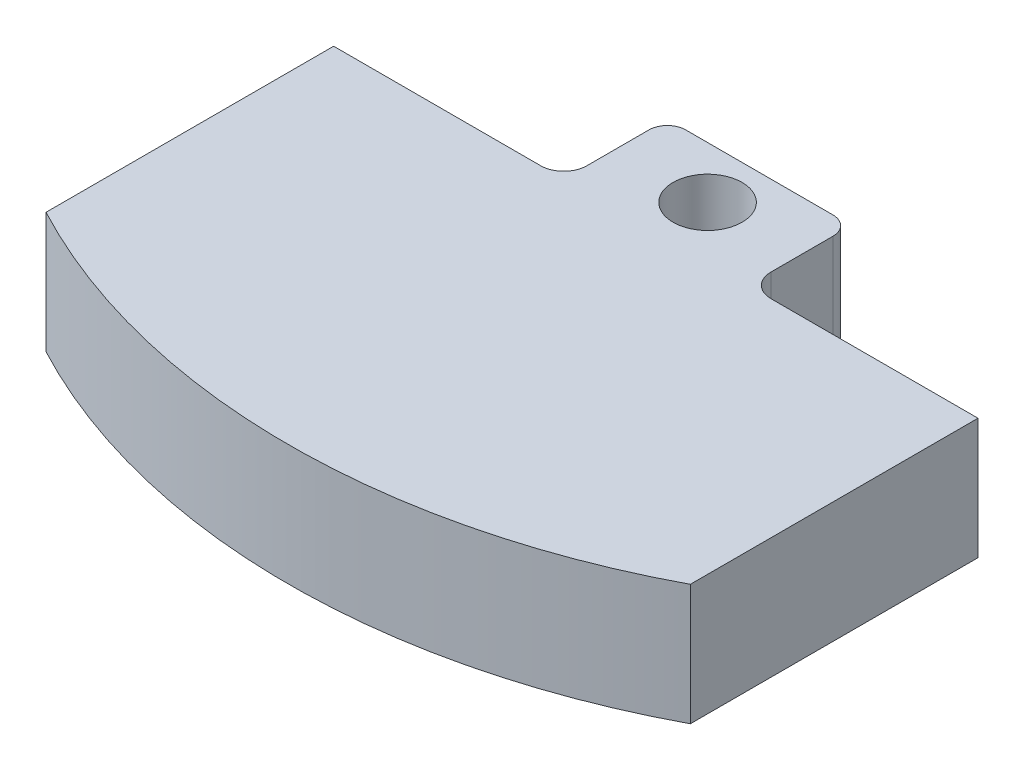
ISO-10303-21;
HEADER;
FILE_DESCRIPTION(('STEP AP214'),'2;1');
FILE_NAME('part.step','',(''),(''),'','','');
FILE_SCHEMA(('AUTOMOTIVE_DESIGN { 1 0 10303 214 1 1 1 1 }'));
ENDSEC;
DATA;
#1=APPLICATION_CONTEXT('core data for automotive mechanical design processes');
#2=APPLICATION_PROTOCOL_DEFINITION('international standard','automotive_design',2000,#1);
#3=PRODUCT_CONTEXT('',#1,'mechanical');
#4=PRODUCT('Part','Part','',(#3));
#5=PRODUCT_RELATED_PRODUCT_CATEGORY('part','',(#4));
#6=PRODUCT_DEFINITION_FORMATION('','',#4);
#7=PRODUCT_DEFINITION_CONTEXT('part definition',#1,'design');
#8=PRODUCT_DEFINITION('design','',#6,#7);
#9=PRODUCT_DEFINITION_SHAPE('','',#8);
#10=(LENGTH_UNIT() NAMED_UNIT(*) SI_UNIT(.MILLI.,.METRE.));
#11=(NAMED_UNIT(*) PLANE_ANGLE_UNIT() SI_UNIT($,.RADIAN.));
#12=(NAMED_UNIT(*) SI_UNIT($,.STERADIAN.) SOLID_ANGLE_UNIT());
#13=UNCERTAINTY_MEASURE_WITH_UNIT(LENGTH_MEASURE(1.E-05),#10,'distance_accuracy_value','');
#14=(GEOMETRIC_REPRESENTATION_CONTEXT(3) GLOBAL_UNCERTAINTY_ASSIGNED_CONTEXT((#13)) GLOBAL_UNIT_ASSIGNED_CONTEXT((#10,
#11,#12)) REPRESENTATION_CONTEXT('',''));
#15=CARTESIAN_POINT('',(0.,0.,0.));
#16=DIRECTION('',(0.,0.,1.));
#17=DIRECTION('',(1.,0.,0.));
#18=AXIS2_PLACEMENT_3D('',#15,#16,#17);
#19=CARTESIAN_POINT('',(0.,13.335,0.));
#20=DIRECTION('',(1.,0.,0.));
#21=DIRECTION('',(0.,0.,-1.));
#22=AXIS2_PLACEMENT_3D('',#19,#20,#21);
#23=PLANE('',#22);
#24=DIRECTION('',(0.,0.,1.));
#25=VECTOR('',#24,1.);
#26=CARTESIAN_POINT('',(0.,13.335,0.));
#27=LINE('',#26,#25);
#28=CARTESIAN_POINT('',(0.,13.335,11.43));
#29=VERTEX_POINT('',#28);
#30=CARTESIAN_POINT('',(0.,13.335,43.18));
#31=VERTEX_POINT('',#30);
#32=EDGE_CURVE('E146',#29,#31,#27,.T.);
#33=ORIENTED_EDGE('',*,*,#32,.F.);
#34=DIRECTION('',(0.,1.,0.));
#35=VECTOR('',#34,1.);
#36=CARTESIAN_POINT('',(0.,0.,11.43));
#37=LINE('',#36,#35);
#38=CARTESIAN_POINT('',(0.,0.,11.43));
#39=VERTEX_POINT('',#38);
#40=EDGE_CURVE('E132',#39,#29,#37,.T.);
#41=ORIENTED_EDGE('',*,*,#40,.F.);
#42=DIRECTION('',(0.,0.,1.));
#43=VECTOR('',#42,1.);
#44=CARTESIAN_POINT('',(0.,0.,0.));
#45=LINE('',#44,#43);
#46=CARTESIAN_POINT('',(0.,0.,43.18));
#47=VERTEX_POINT('',#46);
#48=EDGE_CURVE('E144',#39,#47,#45,.T.);
#49=ORIENTED_EDGE('',*,*,#48,.T.);
#50=DIRECTION('',(0.,-1.,0.));
#51=VECTOR('',#50,1.);
#52=CARTESIAN_POINT('',(0.,13.335,43.18));
#53=LINE('',#52,#51);
#54=EDGE_CURVE('E166',#31,#47,#53,.T.);
#55=ORIENTED_EDGE('',*,*,#54,.F.);
#56=EDGE_LOOP('',(#33,#41,#49,#55));
#57=FACE_BOUND('',#56,.T.);
#58=ADVANCED_FACE('F39',(#57),#23,.F.);
#59=CARTESIAN_POINT('',(35.56,13.335,-23.9875993318207));
#60=DIRECTION('',(0.,-1.,0.));
#61=DIRECTION('',(0.,0.,-1.));
#62=AXIS2_PLACEMENT_3D('',#59,#60,#61);
#63=CYLINDRICAL_SURFACE('',#62,76.);
#64=CARTESIAN_POINT('',(35.56,0.,-23.9875993318207));
#65=DIRECTION('',(0.,1.,0.));
#66=DIRECTION('',(0.,0.,-1.));
#67=AXIS2_PLACEMENT_3D('',#64,#65,#66);
#68=CIRCLE('',#67,76.);
#69=CARTESIAN_POINT('',(71.12,0.,43.18));
#70=VERTEX_POINT('',#69);
#71=EDGE_CURVE('E150',#47,#70,#68,.T.);
#72=ORIENTED_EDGE('',*,*,#71,.T.);
#73=DIRECTION('',(0.,-1.,0.));
#74=VECTOR('',#73,1.);
#75=CARTESIAN_POINT('',(71.12,13.335,43.18));
#76=LINE('',#75,#74);
#77=CARTESIAN_POINT('',(71.12,13.335,43.18));
#78=VERTEX_POINT('',#77);
#79=EDGE_CURVE('E163',#78,#70,#76,.T.);
#80=ORIENTED_EDGE('',*,*,#79,.F.);
#81=CARTESIAN_POINT('',(35.56,13.335,-23.9875993318207));
#82=DIRECTION('',(0.,1.,0.));
#83=DIRECTION('',(0.,0.,-1.));
#84=AXIS2_PLACEMENT_3D('',#81,#82,#83);
#85=CIRCLE('',#84,76.);
#86=EDGE_CURVE('E224',#31,#78,#85,.T.);
#87=ORIENTED_EDGE('',*,*,#86,.F.);
#88=ORIENTED_EDGE('',*,*,#54,.T.);
#89=EDGE_LOOP('',(#72,#80,#87,#88));
#90=FACE_BOUND('',#89,.T.);
#91=ADVANCED_FACE('F266',(#90),#63,.T.);
#92=CARTESIAN_POINT('',(71.12,13.335,0.));
#93=DIRECTION('',(-1.,0.,0.));
#94=DIRECTION('',(0.,0.,1.));
#95=AXIS2_PLACEMENT_3D('',#92,#93,#94);
#96=PLANE('',#95);
#97=DIRECTION('',(0.,0.,-1.));
#98=VECTOR('',#97,1.);
#99=CARTESIAN_POINT('',(71.12,0.,0.));
#100=LINE('',#99,#98);
#101=CARTESIAN_POINT('',(71.12,0.,11.43));
#102=VERTEX_POINT('',#101);
#103=EDGE_CURVE('E153',#70,#102,#100,.T.);
#104=ORIENTED_EDGE('',*,*,#103,.T.);
#105=DIRECTION('',(0.,1.,0.));
#106=VECTOR('',#105,1.);
#107=CARTESIAN_POINT('',(71.12,0.,11.43));
#108=LINE('',#107,#106);
#109=CARTESIAN_POINT('',(71.12,13.335,11.43));
#110=VERTEX_POINT('',#109);
#111=EDGE_CURVE('E231',#102,#110,#108,.T.);
#112=ORIENTED_EDGE('',*,*,#111,.T.);
#113=DIRECTION('',(0.,0.,-1.));
#114=VECTOR('',#113,1.);
#115=CARTESIAN_POINT('',(71.12,13.335,0.));
#116=LINE('',#115,#114);
#117=EDGE_CURVE('E222',#78,#110,#116,.T.);
#118=ORIENTED_EDGE('',*,*,#117,.F.);
#119=ORIENTED_EDGE('',*,*,#79,.T.);
#120=EDGE_LOOP('',(#104,#112,#118,#119));
#121=FACE_BOUND('',#120,.T.);
#122=ADVANCED_FACE('F272',(#121),#96,.F.);
#123=CARTESIAN_POINT('',(0.,13.335,0.));
#124=DIRECTION('',(0.,0.,1.));
#125=DIRECTION('',(1.,0.,0.));
#126=AXIS2_PLACEMENT_3D('',#123,#124,#125);
#127=PLANE('',#126);
#128=DIRECTION('',(-1.,0.,0.));
#129=VECTOR('',#128,1.);
#130=CARTESIAN_POINT('',(0.,13.335,0.));
#131=LINE('',#130,#129);
#132=CARTESIAN_POINT('',(43.688,13.335,0.));
#133=VERTEX_POINT('',#132);
#134=CARTESIAN_POINT('',(27.432,13.335,0.));
#135=VERTEX_POINT('',#134);
#136=EDGE_CURVE('E156',#133,#135,#131,.T.);
#137=ORIENTED_EDGE('',*,*,#136,.F.);
#138=DIRECTION('',(0.,1.,0.));
#139=VECTOR('',#138,1.);
#140=CARTESIAN_POINT('',(43.688,13.335,0.));
#141=LINE('',#140,#139);
#142=CARTESIAN_POINT('',(43.688,0.,0.));
#143=VERTEX_POINT('',#142);
#144=EDGE_CURVE('E197',#133,#143,#141,.F.);
#145=ORIENTED_EDGE('',*,*,#144,.T.);
#146=DIRECTION('',(-1.,0.,0.));
#147=VECTOR('',#146,1.);
#148=CARTESIAN_POINT('',(0.,0.,0.));
#149=LINE('',#148,#147);
#150=CARTESIAN_POINT('',(27.432,0.,0.));
#151=VERTEX_POINT('',#150);
#152=EDGE_CURVE('E161',#143,#151,#149,.T.);
#153=ORIENTED_EDGE('',*,*,#152,.T.);
#154=DIRECTION('',(0.,1.,0.));
#155=VECTOR('',#154,1.);
#156=CARTESIAN_POINT('',(27.432,13.335,0.));
#157=LINE('',#156,#155);
#158=EDGE_CURVE('E194',#151,#135,#157,.T.);
#159=ORIENTED_EDGE('',*,*,#158,.T.);
#160=EDGE_LOOP('',(#137,#145,#153,#159));
#161=FACE_BOUND('',#160,.T.);
#162=ADVANCED_FACE('F220',(#161),#127,.F.);
#163=CARTESIAN_POINT('',(35.56,13.335,-23.9875993318207));
#164=DIRECTION('',(0.,-1.,0.));
#165=DIRECTION('',(0.,0.,-1.));
#166=AXIS2_PLACEMENT_3D('',#163,#164,#165);
#167=PLANE('',#166);
#168=CARTESIAN_POINT('',(35.56,13.335,5.7189125026791));
#169=DIRECTION('',(0.,-1.,0.));
#170=DIRECTION('',(0.,0.,-1.));
#171=AXIS2_PLACEMENT_3D('',#168,#169,#170);
#172=CIRCLE('',#171,3.81);
#173=CARTESIAN_POINT('',(35.56,13.335,1.9089125026791));
#174=VERTEX_POINT('',#173);
#175=EDGE_CURVE('E236',#174,#174,#172,.T.);
#176=ORIENTED_EDGE('',*,*,#175,.T.);
#177=EDGE_LOOP('',(#176));
#178=FACE_BOUND('',#177,.T.);
#179=DIRECTION('',(0.,0.,1.));
#180=VECTOR('',#179,1.);
#181=CARTESIAN_POINT('',(45.72,13.335,0.));
#182=LINE('',#181,#180);
#183=CARTESIAN_POINT('',(45.72,13.335,2.032));
#184=VERTEX_POINT('',#183);
#185=CARTESIAN_POINT('',(45.72,13.335,8.89));
#186=VERTEX_POINT('',#185);
#187=EDGE_CURVE('E218',#184,#186,#182,.T.);
#188=ORIENTED_EDGE('',*,*,#187,.F.);
#189=CARTESIAN_POINT('',(43.688,13.335,2.032));
#190=DIRECTION('',(0.,-1.,0.));
#191=DIRECTION('',(0.,0.,-1.));
#192=AXIS2_PLACEMENT_3D('',#189,#190,#191);
#193=CIRCLE('',#192,2.032);
#194=EDGE_CURVE('E192',#184,#133,#193,.F.);
#195=ORIENTED_EDGE('',*,*,#194,.T.);
#196=ORIENTED_EDGE('',*,*,#136,.T.);
#197=CARTESIAN_POINT('',(27.432,13.335,2.032));
#198=DIRECTION('',(0.,-1.,0.));
#199=DIRECTION('',(0.,0.,-1.));
#200=AXIS2_PLACEMENT_3D('',#197,#198,#199);
#201=CIRCLE('',#200,2.032);
#202=CARTESIAN_POINT('',(25.4,13.335,2.032));
#203=VERTEX_POINT('',#202);
#204=EDGE_CURVE('E190',#135,#203,#201,.F.);
#205=ORIENTED_EDGE('',*,*,#204,.T.);
#206=DIRECTION('',(0.,0.,-1.));
#207=VECTOR('',#206,1.);
#208=CARTESIAN_POINT('',(25.4,13.335,0.));
#209=LINE('',#208,#207);
#210=CARTESIAN_POINT('',(25.4,13.335,8.89));
#211=VERTEX_POINT('',#210);
#212=EDGE_CURVE('E139',#211,#203,#209,.T.);
#213=ORIENTED_EDGE('',*,*,#212,.F.);
#214=CARTESIAN_POINT('',(22.86,13.335,8.89));
#215=DIRECTION('',(0.,-1.,0.));
#216=DIRECTION('',(0.,0.,-1.));
#217=AXIS2_PLACEMENT_3D('',#214,#215,#216);
#218=CIRCLE('',#217,2.54);
#219=CARTESIAN_POINT('',(22.86,13.335,11.43));
#220=VERTEX_POINT('',#219);
#221=EDGE_CURVE('E183',#211,#220,#218,.T.);
#222=ORIENTED_EDGE('',*,*,#221,.T.);
#223=DIRECTION('',(1.,0.,0.));
#224=VECTOR('',#223,1.);
#225=CARTESIAN_POINT('',(0.,13.335,11.43));
#226=LINE('',#225,#224);
#227=EDGE_CURVE('E233',#29,#220,#226,.T.);
#228=ORIENTED_EDGE('',*,*,#227,.F.);
#229=ORIENTED_EDGE('',*,*,#32,.T.);
#230=ORIENTED_EDGE('',*,*,#86,.T.);
#231=ORIENTED_EDGE('',*,*,#117,.T.);
#232=DIRECTION('',(1.,0.,0.));
#233=VECTOR('',#232,1.);
#234=CARTESIAN_POINT('',(71.12,13.335,11.43));
#235=LINE('',#234,#233);
#236=CARTESIAN_POINT('',(48.26,13.335,11.43));
#237=VERTEX_POINT('',#236);
#238=EDGE_CURVE('E210',#237,#110,#235,.T.);
#239=ORIENTED_EDGE('',*,*,#238,.F.);
#240=CARTESIAN_POINT('',(48.26,13.335,8.89));
#241=DIRECTION('',(0.,-1.,0.));
#242=DIRECTION('',(0.,0.,-1.));
#243=AXIS2_PLACEMENT_3D('',#240,#241,#242);
#244=CIRCLE('',#243,2.54);
#245=EDGE_CURVE('E178',#237,#186,#244,.T.);
#246=ORIENTED_EDGE('',*,*,#245,.T.);
#247=EDGE_LOOP('',(#188,#195,#196,#205,#213,#222,#228,#229,#230,#231,#239,#246));
#248=FACE_BOUND('',#247,.T.);
#249=ADVANCED_FACE('F217',(#178,#248),#167,.F.);
#250=CARTESIAN_POINT('',(35.56,0.,-23.9875993318207));
#251=DIRECTION('',(0.,-1.,0.));
#252=DIRECTION('',(0.,0.,-1.));
#253=AXIS2_PLACEMENT_3D('',#250,#251,#252);
#254=PLANE('',#253);
#255=CARTESIAN_POINT('',(35.56,0.,5.7189125026791));
#256=DIRECTION('',(0.,-1.,0.));
#257=DIRECTION('',(0.,0.,-1.));
#258=AXIS2_PLACEMENT_3D('',#255,#256,#257);
#259=CIRCLE('',#258,3.81);
#260=CARTESIAN_POINT('',(35.56,0.,1.9089125026791));
#261=VERTEX_POINT('',#260);
#262=EDGE_CURVE('E241',#261,#261,#259,.T.);
#263=ORIENTED_EDGE('',*,*,#262,.F.);
#264=EDGE_LOOP('',(#263));
#265=FACE_BOUND('',#264,.T.);
#266=ORIENTED_EDGE('',*,*,#152,.F.);
#267=CARTESIAN_POINT('',(43.688,0.,2.032));
#268=DIRECTION('',(0.,-1.,0.));
#269=DIRECTION('',(0.,0.,-1.));
#270=AXIS2_PLACEMENT_3D('',#267,#268,#269);
#271=CIRCLE('',#270,2.032);
#272=CARTESIAN_POINT('',(45.72,0.,2.032));
#273=VERTEX_POINT('',#272);
#274=EDGE_CURVE('E47',#143,#273,#271,.T.);
#275=ORIENTED_EDGE('',*,*,#274,.T.);
#276=DIRECTION('',(0.,0.,1.));
#277=VECTOR('',#276,1.);
#278=CARTESIAN_POINT('',(45.72,0.,0.));
#279=LINE('',#278,#277);
#280=CARTESIAN_POINT('',(45.72,0.,8.89));
#281=VERTEX_POINT('',#280);
#282=EDGE_CURVE('E201',#273,#281,#279,.T.);
#283=ORIENTED_EDGE('',*,*,#282,.T.);
#284=CARTESIAN_POINT('',(48.26,0.,8.89));
#285=DIRECTION('',(0.,-1.,0.));
#286=DIRECTION('',(0.,0.,-1.));
#287=AXIS2_PLACEMENT_3D('',#284,#285,#286);
#288=CIRCLE('',#287,2.54);
#289=CARTESIAN_POINT('',(48.26,0.,11.43));
#290=VERTEX_POINT('',#289);
#291=EDGE_CURVE('E181',#281,#290,#288,.F.);
#292=ORIENTED_EDGE('',*,*,#291,.T.);
#293=DIRECTION('',(1.,0.,0.));
#294=VECTOR('',#293,1.);
#295=CARTESIAN_POINT('',(71.12,0.,11.43));
#296=LINE('',#295,#294);
#297=EDGE_CURVE('E211',#290,#102,#296,.T.);
#298=ORIENTED_EDGE('',*,*,#297,.T.);
#299=ORIENTED_EDGE('',*,*,#103,.F.);
#300=ORIENTED_EDGE('',*,*,#71,.F.);
#301=ORIENTED_EDGE('',*,*,#48,.F.);
#302=DIRECTION('',(1.,0.,0.));
#303=VECTOR('',#302,1.);
#304=CARTESIAN_POINT('',(0.,0.,11.43));
#305=LINE('',#304,#303);
#306=CARTESIAN_POINT('',(22.86,0.,11.43));
#307=VERTEX_POINT('',#306);
#308=EDGE_CURVE('E128',#39,#307,#305,.T.);
#309=ORIENTED_EDGE('',*,*,#308,.T.);
#310=CARTESIAN_POINT('',(22.86,0.,8.89));
#311=DIRECTION('',(0.,-1.,0.));
#312=DIRECTION('',(0.,0.,-1.));
#313=AXIS2_PLACEMENT_3D('',#310,#311,#312);
#314=CIRCLE('',#313,2.54);
#315=CARTESIAN_POINT('',(25.4,0.,8.89));
#316=VERTEX_POINT('',#315);
#317=EDGE_CURVE('E185',#307,#316,#314,.F.);
#318=ORIENTED_EDGE('',*,*,#317,.T.);
#319=DIRECTION('',(0.,0.,-1.));
#320=VECTOR('',#319,1.);
#321=CARTESIAN_POINT('',(25.4,0.,0.));
#322=LINE('',#321,#320);
#323=CARTESIAN_POINT('',(25.4,0.,2.032));
#324=VERTEX_POINT('',#323);
#325=EDGE_CURVE('E138',#316,#324,#322,.T.);
#326=ORIENTED_EDGE('',*,*,#325,.T.);
#327=CARTESIAN_POINT('',(27.432,0.,2.032));
#328=DIRECTION('',(0.,-1.,0.));
#329=DIRECTION('',(0.,0.,-1.));
#330=AXIS2_PLACEMENT_3D('',#327,#328,#329);
#331=CIRCLE('',#330,2.032);
#332=EDGE_CURVE('E59',#324,#151,#331,.T.);
#333=ORIENTED_EDGE('',*,*,#332,.T.);
#334=EDGE_LOOP('',(#266,#275,#283,#292,#298,#299,#300,#301,#309,#318,#326,#333));
#335=FACE_BOUND('',#334,.T.);
#336=ADVANCED_FACE('F148',(#265,#335),#254,.T.);
#337=CARTESIAN_POINT('',(71.12,0.,11.43));
#338=DIRECTION('',(0.,0.,1.));
#339=DIRECTION('',(1.,0.,0.));
#340=AXIS2_PLACEMENT_3D('',#337,#338,#339);
#341=PLANE('',#340);
#342=ORIENTED_EDGE('',*,*,#297,.F.);
#343=DIRECTION('',(0.,1.,0.));
#344=VECTOR('',#343,1.);
#345=CARTESIAN_POINT('',(48.26,13.335,11.43));
#346=LINE('',#345,#344);
#347=EDGE_CURVE('E168',#290,#237,#346,.T.);
#348=ORIENTED_EDGE('',*,*,#347,.T.);
#349=ORIENTED_EDGE('',*,*,#238,.T.);
#350=ORIENTED_EDGE('',*,*,#111,.F.);
#351=EDGE_LOOP('',(#342,#348,#349,#350));
#352=FACE_BOUND('',#351,.T.);
#353=ADVANCED_FACE('F255',(#352),#341,.F.);
#354=CARTESIAN_POINT('',(45.72,0.,0.));
#355=DIRECTION('',(-1.,0.,0.));
#356=DIRECTION('',(0.,0.,1.));
#357=AXIS2_PLACEMENT_3D('',#354,#355,#356);
#358=PLANE('',#357);
#359=ORIENTED_EDGE('',*,*,#282,.F.);
#360=DIRECTION('',(0.,1.,0.));
#361=VECTOR('',#360,1.);
#362=CARTESIAN_POINT('',(45.72,0.,2.032));
#363=LINE('',#362,#361);
#364=EDGE_CURVE('E187',#273,#184,#363,.T.);
#365=ORIENTED_EDGE('',*,*,#364,.T.);
#366=ORIENTED_EDGE('',*,*,#187,.T.);
#367=DIRECTION('',(0.,1.,0.));
#368=VECTOR('',#367,1.);
#369=CARTESIAN_POINT('',(45.72,0.,8.89));
#370=LINE('',#369,#368);
#371=EDGE_CURVE('E171',#186,#281,#370,.F.);
#372=ORIENTED_EDGE('',*,*,#371,.T.);
#373=EDGE_LOOP('',(#359,#365,#366,#372));
#374=FACE_BOUND('',#373,.T.);
#375=ADVANCED_FACE('F206',(#374),#358,.F.);
#376=CARTESIAN_POINT('',(25.4,0.,0.));
#377=DIRECTION('',(1.,0.,0.));
#378=DIRECTION('',(0.,0.,-1.));
#379=AXIS2_PLACEMENT_3D('',#376,#377,#378);
#380=PLANE('',#379);
#381=ORIENTED_EDGE('',*,*,#212,.T.);
#382=DIRECTION('',(0.,1.,0.));
#383=VECTOR('',#382,1.);
#384=CARTESIAN_POINT('',(25.4,0.,2.032));
#385=LINE('',#384,#383);
#386=EDGE_CURVE('E11',#203,#324,#385,.F.);
#387=ORIENTED_EDGE('',*,*,#386,.T.);
#388=ORIENTED_EDGE('',*,*,#325,.F.);
#389=DIRECTION('',(0.,1.,0.));
#390=VECTOR('',#389,1.);
#391=CARTESIAN_POINT('',(25.4,13.335,8.89));
#392=LINE('',#391,#390);
#393=EDGE_CURVE('E174',#316,#211,#392,.T.);
#394=ORIENTED_EDGE('',*,*,#393,.T.);
#395=EDGE_LOOP('',(#381,#387,#388,#394));
#396=FACE_BOUND('',#395,.T.);
#397=ADVANCED_FACE('F293',(#396),#380,.F.);
#398=CARTESIAN_POINT('',(0.,0.,11.43));
#399=DIRECTION('',(0.,0.,1.));
#400=DIRECTION('',(1.,0.,0.));
#401=AXIS2_PLACEMENT_3D('',#398,#399,#400);
#402=PLANE('',#401);
#403=ORIENTED_EDGE('',*,*,#227,.T.);
#404=DIRECTION('',(0.,1.,0.));
#405=VECTOR('',#404,1.);
#406=CARTESIAN_POINT('',(22.86,0.,11.43));
#407=LINE('',#406,#405);
#408=EDGE_CURVE('E135',#220,#307,#407,.F.);
#409=ORIENTED_EDGE('',*,*,#408,.T.);
#410=ORIENTED_EDGE('',*,*,#308,.F.);
#411=ORIENTED_EDGE('',*,*,#40,.T.);
#412=EDGE_LOOP('',(#403,#409,#410,#411));
#413=FACE_BOUND('',#412,.T.);
#414=ADVANCED_FACE('F131',(#413),#402,.F.);
#415=CARTESIAN_POINT('',(48.26,0.,8.89));
#416=DIRECTION('',(0.,-1.,0.));
#417=DIRECTION('',(0.,0.,-1.));
#418=AXIS2_PLACEMENT_3D('',#415,#416,#417);
#419=CYLINDRICAL_SURFACE('',#418,2.54);
#420=ORIENTED_EDGE('',*,*,#291,.F.);
#421=ORIENTED_EDGE('',*,*,#371,.F.);
#422=ORIENTED_EDGE('',*,*,#245,.F.);
#423=ORIENTED_EDGE('',*,*,#347,.F.);
#424=EDGE_LOOP('',(#420,#421,#422,#423));
#425=FACE_BOUND('',#424,.T.);
#426=ADVANCED_FACE('F277',(#425),#419,.F.);
#427=CARTESIAN_POINT('',(22.86,0.,8.89));
#428=DIRECTION('',(0.,-1.,0.));
#429=DIRECTION('',(0.,0.,-1.));
#430=AXIS2_PLACEMENT_3D('',#427,#428,#429);
#431=CYLINDRICAL_SURFACE('',#430,2.54);
#432=ORIENTED_EDGE('',*,*,#317,.F.);
#433=ORIENTED_EDGE('',*,*,#408,.F.);
#434=ORIENTED_EDGE('',*,*,#221,.F.);
#435=ORIENTED_EDGE('',*,*,#393,.F.);
#436=EDGE_LOOP('',(#432,#433,#434,#435));
#437=FACE_BOUND('',#436,.T.);
#438=ADVANCED_FACE('F280',(#437),#431,.F.);
#439=CARTESIAN_POINT('',(43.688,0.,2.032));
#440=DIRECTION('',(0.,1.,0.));
#441=DIRECTION('',(0.,0.,1.));
#442=AXIS2_PLACEMENT_3D('',#439,#440,#441);
#443=CYLINDRICAL_SURFACE('',#442,2.032);
#444=ORIENTED_EDGE('',*,*,#274,.F.);
#445=ORIENTED_EDGE('',*,*,#144,.F.);
#446=ORIENTED_EDGE('',*,*,#194,.F.);
#447=ORIENTED_EDGE('',*,*,#364,.F.);
#448=EDGE_LOOP('',(#444,#445,#446,#447));
#449=FACE_BOUND('',#448,.T.);
#450=ADVANCED_FACE('F213',(#449),#443,.T.);
#451=CARTESIAN_POINT('',(27.432,13.335,2.032));
#452=DIRECTION('',(0.,1.,0.));
#453=DIRECTION('',(0.,0.,1.));
#454=AXIS2_PLACEMENT_3D('',#451,#452,#453);
#455=CYLINDRICAL_SURFACE('',#454,2.032);
#456=ORIENTED_EDGE('',*,*,#332,.F.);
#457=ORIENTED_EDGE('',*,*,#386,.F.);
#458=ORIENTED_EDGE('',*,*,#204,.F.);
#459=ORIENTED_EDGE('',*,*,#158,.F.);
#460=EDGE_LOOP('',(#456,#457,#458,#459));
#461=FACE_BOUND('',#460,.T.);
#462=ADVANCED_FACE('F41',(#461),#455,.T.);
#463=CARTESIAN_POINT('',(35.56,13.335,5.7189125026791));
#464=DIRECTION('',(0.,-1.,0.));
#465=DIRECTION('',(0.,0.,-1.));
#466=AXIS2_PLACEMENT_3D('',#463,#464,#465);
#467=CYLINDRICAL_SURFACE('',#466,3.81);
#468=ORIENTED_EDGE('',*,*,#175,.F.);
#469=EDGE_LOOP('',(#468));
#470=FACE_BOUND('',#469,.T.);
#471=ORIENTED_EDGE('',*,*,#262,.T.);
#472=EDGE_LOOP('',(#471));
#473=FACE_BOUND('',#472,.T.);
#474=ADVANCED_FACE('F248',(#470,#473),#467,.F.);
#475=CLOSED_SHELL('',(#58,#91,#122,#162,#249,#336,#353,#375,#397,#414,#426,#438,#450,#462,#474));
#476=MANIFOLD_SOLID_BREP('B2',#475);
#477=ADVANCED_BREP_SHAPE_REPRESENTATION('',(#18,#476),#14);
#478=SHAPE_DEFINITION_REPRESENTATION(#9,#477);
ENDSEC;
END-ISO-10303-21;
